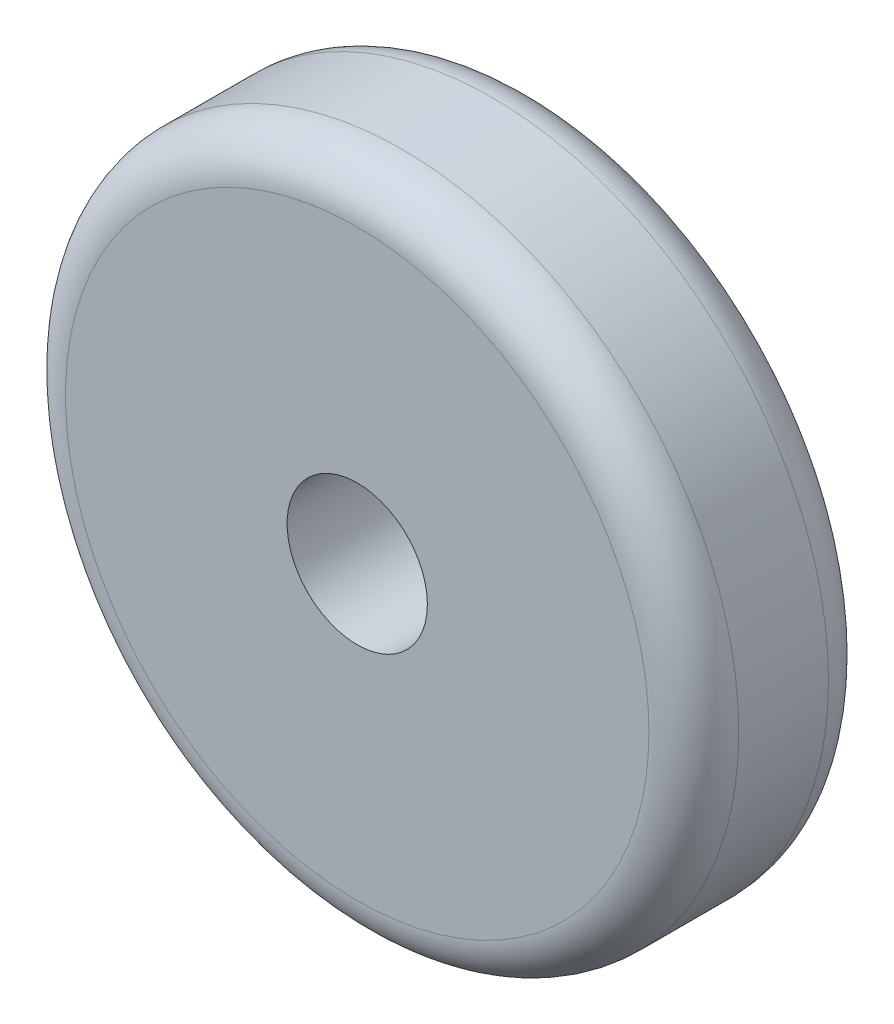
ISO-10303-21;
HEADER;
FILE_DESCRIPTION(('STEP AP214'),'2;1');
FILE_NAME('part.step','',(''),(''),'','','');
FILE_SCHEMA(('AUTOMOTIVE_DESIGN { 1 0 10303 214 1 1 1 1 }'));
ENDSEC;
DATA;
#1=APPLICATION_CONTEXT('core data for automotive mechanical design processes');
#2=APPLICATION_PROTOCOL_DEFINITION('international standard','automotive_design',2000,#1);
#3=PRODUCT_CONTEXT('',#1,'mechanical');
#4=PRODUCT('Part','Part','',(#3));
#5=PRODUCT_RELATED_PRODUCT_CATEGORY('part','',(#4));
#6=PRODUCT_DEFINITION_FORMATION('','',#4);
#7=PRODUCT_DEFINITION_CONTEXT('part definition',#1,'design');
#8=PRODUCT_DEFINITION('design','',#6,#7);
#9=PRODUCT_DEFINITION_SHAPE('','',#8);
#10=(LENGTH_UNIT() NAMED_UNIT(*) SI_UNIT(.MILLI.,.METRE.));
#11=(NAMED_UNIT(*) PLANE_ANGLE_UNIT() SI_UNIT($,.RADIAN.));
#12=(NAMED_UNIT(*) SI_UNIT($,.STERADIAN.) SOLID_ANGLE_UNIT());
#13=UNCERTAINTY_MEASURE_WITH_UNIT(LENGTH_MEASURE(1.E-05),#10,'distance_accuracy_value','');
#14=(GEOMETRIC_REPRESENTATION_CONTEXT(3) GLOBAL_UNCERTAINTY_ASSIGNED_CONTEXT((#13)) GLOBAL_UNIT_ASSIGNED_CONTEXT((#10,
#11,#12)) REPRESENTATION_CONTEXT('',''));
#15=CARTESIAN_POINT('',(0.,0.,0.));
#16=DIRECTION('',(0.,0.,1.));
#17=DIRECTION('',(1.,0.,0.));
#18=AXIS2_PLACEMENT_3D('',#15,#16,#17);
#19=CARTESIAN_POINT('',(0.,0.,10.16));
#20=DIRECTION('',(0.,0.,1.));
#21=DIRECTION('',(1.,0.,0.));
#22=AXIS2_PLACEMENT_3D('',#19,#20,#21);
#23=PLANE('',#22);
#24=CARTESIAN_POINT('',(0.,0.,10.16));
#25=DIRECTION('',(0.,0.,1.));
#26=DIRECTION('',(1.,0.,0.));
#27=AXIS2_PLACEMENT_3D('',#24,#25,#26);
#28=CIRCLE('',#27,16.51);
#29=CARTESIAN_POINT('',(16.51,0.,10.16));
#30=VERTEX_POINT('',#29);
#31=EDGE_CURVE('E54',#30,#30,#28,.T.);
#32=ORIENTED_EDGE('',*,*,#31,.T.);
#33=EDGE_LOOP('',(#32));
#34=FACE_BOUND('',#33,.T.);
#35=CARTESIAN_POINT('',(0.,0.,10.16));
#36=DIRECTION('',(0.,0.,1.));
#37=DIRECTION('',(1.,0.,0.));
#38=AXIS2_PLACEMENT_3D('',#35,#36,#37);
#39=CIRCLE('',#38,3.96875);
#40=CARTESIAN_POINT('',(3.96875,0.,10.16));
#41=VERTEX_POINT('',#40);
#42=EDGE_CURVE('E60',#41,#41,#39,.T.);
#43=ORIENTED_EDGE('',*,*,#42,.F.);
#44=EDGE_LOOP('',(#43));
#45=FACE_BOUND('',#44,.T.);
#46=ADVANCED_FACE('F36',(#34,#45),#23,.T.);
#47=CARTESIAN_POINT('',(0.,0.,0.));
#48=DIRECTION('',(0.,0.,1.));
#49=DIRECTION('',(1.,0.,0.));
#50=AXIS2_PLACEMENT_3D('',#47,#48,#49);
#51=PLANE('',#50);
#52=CARTESIAN_POINT('',(0.,0.,0.));
#53=DIRECTION('',(0.,0.,1.));
#54=DIRECTION('',(1.,0.,0.));
#55=AXIS2_PLACEMENT_3D('',#52,#53,#54);
#56=CIRCLE('',#55,16.51);
#57=CARTESIAN_POINT('',(16.51,0.,0.));
#58=VERTEX_POINT('',#57);
#59=EDGE_CURVE('E10',#58,#58,#56,.F.);
#60=ORIENTED_EDGE('',*,*,#59,.T.);
#61=EDGE_LOOP('',(#60));
#62=FACE_BOUND('',#61,.T.);
#63=CARTESIAN_POINT('',(0.,0.,0.));
#64=DIRECTION('',(0.,0.,1.));
#65=DIRECTION('',(1.,0.,0.));
#66=AXIS2_PLACEMENT_3D('',#63,#64,#65);
#67=CIRCLE('',#66,3.96875);
#68=CARTESIAN_POINT('',(3.96875,0.,0.));
#69=VERTEX_POINT('',#68);
#70=EDGE_CURVE('E61',#69,#69,#67,.T.);
#71=ORIENTED_EDGE('',*,*,#70,.T.);
#72=EDGE_LOOP('',(#71));
#73=FACE_BOUND('',#72,.T.);
#74=ADVANCED_FACE('F73',(#62,#73),#51,.F.);
#75=CARTESIAN_POINT('',(0.,0.,10.16));
#76=DIRECTION('',(0.,0.,-1.));
#77=DIRECTION('',(-1.,0.,0.));
#78=AXIS2_PLACEMENT_3D('',#75,#76,#77);
#79=CYLINDRICAL_SURFACE('',#78,19.05);
#80=CARTESIAN_POINT('',(0.,0.,7.62));
#81=DIRECTION('',(0.,0.,1.));
#82=DIRECTION('',(1.,0.,0.));
#83=AXIS2_PLACEMENT_3D('',#80,#81,#82);
#84=CIRCLE('',#83,19.05);
#85=CARTESIAN_POINT('',(19.05,0.,7.62));
#86=VERTEX_POINT('',#85);
#87=EDGE_CURVE('E44',#86,#86,#84,.F.);
#88=ORIENTED_EDGE('',*,*,#87,.T.);
#89=EDGE_LOOP('',(#88));
#90=FACE_BOUND('',#89,.T.);
#91=CARTESIAN_POINT('',(0.,0.,2.54));
#92=DIRECTION('',(0.,0.,1.));
#93=DIRECTION('',(1.,0.,0.));
#94=AXIS2_PLACEMENT_3D('',#91,#92,#93);
#95=CIRCLE('',#94,19.05);
#96=CARTESIAN_POINT('',(19.05,0.,2.54));
#97=VERTEX_POINT('',#96);
#98=EDGE_CURVE('E49',#97,#97,#95,.T.);
#99=ORIENTED_EDGE('',*,*,#98,.T.);
#100=EDGE_LOOP('',(#99));
#101=FACE_BOUND('',#100,.T.);
#102=ADVANCED_FACE('F80',(#90,#101),#79,.T.);
#103=CARTESIAN_POINT('',(0.,0.,10.16));
#104=DIRECTION('',(0.,0.,-1.));
#105=DIRECTION('',(-1.,0.,0.));
#106=AXIS2_PLACEMENT_3D('',#103,#104,#105);
#107=CYLINDRICAL_SURFACE('',#106,3.96875);
#108=ORIENTED_EDGE('',*,*,#42,.T.);
#109=EDGE_LOOP('',(#108));
#110=FACE_BOUND('',#109,.T.);
#111=ORIENTED_EDGE('',*,*,#70,.F.);
#112=EDGE_LOOP('',(#111));
#113=FACE_BOUND('',#112,.T.);
#114=ADVANCED_FACE('F69',(#110,#113),#107,.F.);
#115=CARTESIAN_POINT('',(0.,0.,7.62));
#116=DIRECTION('',(0.,0.,1.));
#117=DIRECTION('',(1.,0.,0.));
#118=AXIS2_PLACEMENT_3D('',#115,#116,#117);
#119=TOROIDAL_SURFACE('',#118,16.51,2.54);
#120=ORIENTED_EDGE('',*,*,#87,.F.);
#121=EDGE_LOOP('',(#120));
#122=FACE_BOUND('',#121,.T.);
#123=ORIENTED_EDGE('',*,*,#31,.F.);
#124=EDGE_LOOP('',(#123));
#125=FACE_BOUND('',#124,.T.);
#126=ADVANCED_FACE('F85',(#122,#125),#119,.T.);
#127=CARTESIAN_POINT('',(0.,0.,2.54));
#128=DIRECTION('',(0.,0.,1.));
#129=DIRECTION('',(1.,0.,0.));
#130=AXIS2_PLACEMENT_3D('',#127,#128,#129);
#131=TOROIDAL_SURFACE('',#130,16.51,2.54);
#132=ORIENTED_EDGE('',*,*,#59,.F.);
#133=EDGE_LOOP('',(#132));
#134=FACE_BOUND('',#133,.T.);
#135=ORIENTED_EDGE('',*,*,#98,.F.);
#136=EDGE_LOOP('',(#135));
#137=FACE_BOUND('',#136,.T.);
#138=ADVANCED_FACE('F38',(#134,#137),#131,.T.);
#139=CLOSED_SHELL('',(#46,#74,#102,#114,#126,#138));
#140=MANIFOLD_SOLID_BREP('B2',#139);
#141=ADVANCED_BREP_SHAPE_REPRESENTATION('',(#18,#140),#14);
#142=SHAPE_DEFINITION_REPRESENTATION(#9,#141);
ENDSEC;
END-ISO-10303-21;
